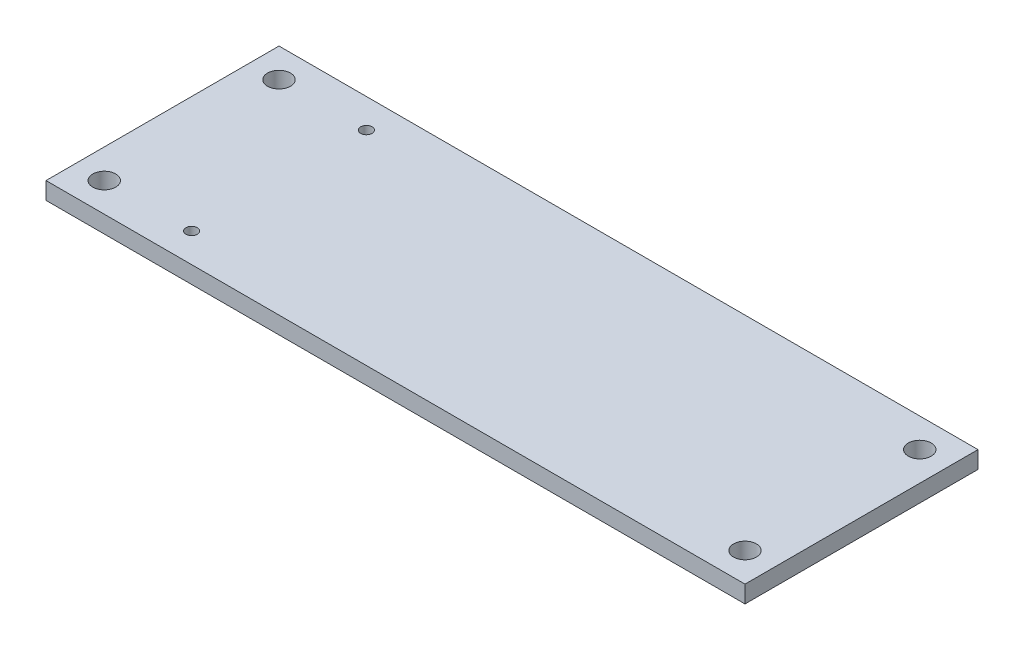
ISO-10303-21;
HEADER;
FILE_DESCRIPTION(('STEP AP214'),'2;1');
FILE_NAME('part.step','',(''),(''),'','','');
FILE_SCHEMA(('AUTOMOTIVE_DESIGN { 1 0 10303 214 1 1 1 1 }'));
ENDSEC;
DATA;
#1=APPLICATION_CONTEXT('core data for automotive mechanical design processes');
#2=APPLICATION_PROTOCOL_DEFINITION('international standard','automotive_design',2000,#1);
#3=PRODUCT_CONTEXT('',#1,'mechanical');
#4=PRODUCT('Part','Part','',(#3));
#5=PRODUCT_RELATED_PRODUCT_CATEGORY('part','',(#4));
#6=PRODUCT_DEFINITION_FORMATION('','',#4);
#7=PRODUCT_DEFINITION_CONTEXT('part definition',#1,'design');
#8=PRODUCT_DEFINITION('design','',#6,#7);
#9=PRODUCT_DEFINITION_SHAPE('','',#8);
#10=(LENGTH_UNIT() NAMED_UNIT(*) SI_UNIT(.MILLI.,.METRE.));
#11=(NAMED_UNIT(*) PLANE_ANGLE_UNIT() SI_UNIT($,.RADIAN.));
#12=(NAMED_UNIT(*) SI_UNIT($,.STERADIAN.) SOLID_ANGLE_UNIT());
#13=UNCERTAINTY_MEASURE_WITH_UNIT(LENGTH_MEASURE(1.E-05),#10,'distance_accuracy_value','');
#14=(GEOMETRIC_REPRESENTATION_CONTEXT(3) GLOBAL_UNCERTAINTY_ASSIGNED_CONTEXT((#13)) GLOBAL_UNIT_ASSIGNED_CONTEXT((#10,
#11,#12)) REPRESENTATION_CONTEXT('',''));
#15=CARTESIAN_POINT('',(0.,0.,0.));
#16=DIRECTION('',(0.,0.,1.));
#17=DIRECTION('',(1.,0.,0.));
#18=AXIS2_PLACEMENT_3D('',#15,#16,#17);
#19=CARTESIAN_POINT('',(0.,0.,0.));
#20=DIRECTION('',(0.,1.,0.));
#21=DIRECTION('',(0.,0.,1.));
#22=AXIS2_PLACEMENT_3D('',#19,#20,#21);
#23=PLANE('',#22);
#24=CARTESIAN_POINT('',(2.54,0.,-17.78));
#25=DIRECTION('',(0.,1.,0.));
#26=DIRECTION('',(0.,0.,1.));
#27=AXIS2_PLACEMENT_3D('',#24,#25,#26);
#28=CIRCLE('',#27,0.999999999999999);
#29=CARTESIAN_POINT('',(2.54,0.,-16.78));
#30=VERTEX_POINT('',#29);
#31=EDGE_CURVE('E158',#30,#30,#28,.F.);
#32=ORIENTED_EDGE('',*,*,#31,.F.);
#33=EDGE_LOOP('',(#32));
#34=FACE_BOUND('',#33,.T.);
#35=CARTESIAN_POINT('',(58.42,0.,-17.78));
#36=DIRECTION('',(0.,1.,0.));
#37=DIRECTION('',(0.,0.,1.));
#38=AXIS2_PLACEMENT_3D('',#35,#36,#37);
#39=CIRCLE('',#38,0.999999999999997);
#40=CARTESIAN_POINT('',(58.42,0.,-16.78));
#41=VERTEX_POINT('',#40);
#42=EDGE_CURVE('E155',#41,#41,#39,.T.);
#43=ORIENTED_EDGE('',*,*,#42,.T.);
#44=EDGE_LOOP('',(#43));
#45=FACE_BOUND('',#44,.T.);
#46=DIRECTION('',(1.,0.,0.));
#47=VECTOR('',#46,1.);
#48=CARTESIAN_POINT('',(0.,0.,0.));
#49=LINE('',#48,#47);
#50=CARTESIAN_POINT('',(0.,0.,0.));
#51=VERTEX_POINT('',#50);
#52=CARTESIAN_POINT('',(60.96,0.,0.));
#53=VERTEX_POINT('',#52);
#54=EDGE_CURVE('E147',#51,#53,#49,.T.);
#55=ORIENTED_EDGE('',*,*,#54,.F.);
#56=DIRECTION('',(0.,0.,-1.));
#57=VECTOR('',#56,1.);
#58=CARTESIAN_POINT('',(0.,0.,0.));
#59=LINE('',#58,#57);
#60=CARTESIAN_POINT('',(0.,0.,-20.32));
#61=VERTEX_POINT('',#60);
#62=EDGE_CURVE('E152',#51,#61,#59,.T.);
#63=ORIENTED_EDGE('',*,*,#62,.T.);
#64=DIRECTION('',(1.,0.,0.));
#65=VECTOR('',#64,1.);
#66=CARTESIAN_POINT('',(0.,0.,-20.32));
#67=LINE('',#66,#65);
#68=CARTESIAN_POINT('',(60.96,0.,-20.32));
#69=VERTEX_POINT('',#68);
#70=EDGE_CURVE('E150',#61,#69,#67,.T.);
#71=ORIENTED_EDGE('',*,*,#70,.T.);
#72=DIRECTION('',(0.,0.,-1.));
#73=VECTOR('',#72,1.);
#74=CARTESIAN_POINT('',(60.96,0.,0.));
#75=LINE('',#74,#73);
#76=EDGE_CURVE('E119',#53,#69,#75,.T.);
#77=ORIENTED_EDGE('',*,*,#76,.F.);
#78=EDGE_LOOP('',(#55,#63,#71,#77));
#79=FACE_BOUND('',#78,.T.);
#80=CARTESIAN_POINT('',(2.54,0.,-2.54));
#81=DIRECTION('',(0.,1.,0.));
#82=DIRECTION('',(0.,0.,1.));
#83=AXIS2_PLACEMENT_3D('',#80,#81,#82);
#84=CIRCLE('',#83,1.);
#85=CARTESIAN_POINT('',(2.54,0.,-1.54));
#86=VERTEX_POINT('',#85);
#87=EDGE_CURVE('E144',#86,#86,#84,.T.);
#88=ORIENTED_EDGE('',*,*,#87,.T.);
#89=EDGE_LOOP('',(#88));
#90=FACE_BOUND('',#89,.T.);
#91=CARTESIAN_POINT('',(58.42,0.,-2.54));
#92=DIRECTION('',(0.,1.,0.));
#93=DIRECTION('',(0.,0.,1.));
#94=AXIS2_PLACEMENT_3D('',#91,#92,#93);
#95=CIRCLE('',#94,0.999999999999998);
#96=CARTESIAN_POINT('',(58.42,0.,-1.54));
#97=VERTEX_POINT('',#96);
#98=EDGE_CURVE('E141',#97,#97,#95,.F.);
#99=ORIENTED_EDGE('',*,*,#98,.F.);
#100=EDGE_LOOP('',(#99));
#101=FACE_BOUND('',#100,.T.);
#102=CARTESIAN_POINT('',(10.16,0.,-2.54));
#103=DIRECTION('',(0.,1.,0.));
#104=DIRECTION('',(0.,0.,1.));
#105=AXIS2_PLACEMENT_3D('',#102,#103,#104);
#106=CIRCLE('',#105,0.500000000000001);
#107=CARTESIAN_POINT('',(10.16,0.,-2.04));
#108=VERTEX_POINT('',#107);
#109=EDGE_CURVE('E137',#108,#108,#106,.T.);
#110=ORIENTED_EDGE('',*,*,#109,.T.);
#111=EDGE_LOOP('',(#110));
#112=FACE_BOUND('',#111,.T.);
#113=CARTESIAN_POINT('',(10.16,0.,-17.78));
#114=DIRECTION('',(0.,1.,0.));
#115=DIRECTION('',(0.,0.,1.));
#116=AXIS2_PLACEMENT_3D('',#113,#114,#115);
#117=CIRCLE('',#116,0.500000000000001);
#118=CARTESIAN_POINT('',(10.16,0.,-17.28));
#119=VERTEX_POINT('',#118);
#120=EDGE_CURVE('E134',#119,#119,#117,.F.);
#121=ORIENTED_EDGE('',*,*,#120,.F.);
#122=EDGE_LOOP('',(#121));
#123=FACE_BOUND('',#122,.T.);
#124=CARTESIAN_POINT('',(53.34,0.,-11.11));
#125=DIRECTION('',(0.,-1.,0.));
#126=DIRECTION('',(0.,0.,-1.));
#127=AXIS2_PLACEMENT_3D('',#124,#125,#126);
#128=CIRCLE('',#127,0.499999999999999);
#129=CARTESIAN_POINT('',(53.34,0.,-11.61));
#130=VERTEX_POINT('',#129);
#131=EDGE_CURVE('E174',#130,#130,#128,.T.);
#132=ORIENTED_EDGE('',*,*,#131,.F.);
#133=EDGE_LOOP('',(#132));
#134=FACE_BOUND('',#133,.T.);
#135=CARTESIAN_POINT('',(53.34,0.,-8.57));
#136=DIRECTION('',(0.,1.,0.));
#137=DIRECTION('',(0.,0.,1.));
#138=AXIS2_PLACEMENT_3D('',#135,#136,#137);
#139=CIRCLE('',#138,0.499999999999999);
#140=CARTESIAN_POINT('',(53.34,0.,-8.07));
#141=VERTEX_POINT('',#140);
#142=EDGE_CURVE('E247',#141,#141,#139,.T.);
#143=ORIENTED_EDGE('',*,*,#142,.T.);
#144=EDGE_LOOP('',(#143));
#145=FACE_BOUND('',#144,.T.);
#146=ADVANCED_FACE('F63',(#34,#45,#79,#90,#101,#112,#123,#134,#145),#23,.F.);
#147=CARTESIAN_POINT('',(2.54,1.5,-17.78));
#148=DIRECTION('',(0.,-1.,0.));
#149=DIRECTION('',(0.,0.,-1.));
#150=AXIS2_PLACEMENT_3D('',#147,#148,#149);
#151=CYLINDRICAL_SURFACE('',#150,0.999999999999999);
#152=CARTESIAN_POINT('',(2.54,1.5,-17.78));
#153=DIRECTION('',(0.,1.,0.));
#154=DIRECTION('',(0.,0.,1.));
#155=AXIS2_PLACEMENT_3D('',#152,#153,#154);
#156=CIRCLE('',#155,0.999999999999999);
#157=CARTESIAN_POINT('',(2.54,1.5,-16.78));
#158=VERTEX_POINT('',#157);
#159=EDGE_CURVE('E131',#158,#158,#156,.F.);
#160=ORIENTED_EDGE('',*,*,#159,.F.);
#161=EDGE_LOOP('',(#160));
#162=FACE_BOUND('',#161,.T.);
#163=ORIENTED_EDGE('',*,*,#31,.T.);
#164=EDGE_LOOP('',(#163));
#165=FACE_BOUND('',#164,.T.);
#166=ADVANCED_FACE('F202',(#162,#165),#151,.F.);
#167=CARTESIAN_POINT('',(58.42,1.5,-17.78));
#168=DIRECTION('',(0.,-1.,0.));
#169=DIRECTION('',(0.,0.,-1.));
#170=AXIS2_PLACEMENT_3D('',#167,#168,#169);
#171=CYLINDRICAL_SURFACE('',#170,0.999999999999997);
#172=CARTESIAN_POINT('',(58.42,1.5,-17.78));
#173=DIRECTION('',(0.,1.,0.));
#174=DIRECTION('',(0.,0.,1.));
#175=AXIS2_PLACEMENT_3D('',#172,#173,#174);
#176=CIRCLE('',#175,0.999999999999997);
#177=CARTESIAN_POINT('',(58.42,1.5,-16.78));
#178=VERTEX_POINT('',#177);
#179=EDGE_CURVE('E125',#178,#178,#176,.T.);
#180=ORIENTED_EDGE('',*,*,#179,.T.);
#181=EDGE_LOOP('',(#180));
#182=FACE_BOUND('',#181,.T.);
#183=ORIENTED_EDGE('',*,*,#42,.F.);
#184=EDGE_LOOP('',(#183));
#185=FACE_BOUND('',#184,.T.);
#186=ADVANCED_FACE('F208',(#182,#185),#171,.F.);
#187=CARTESIAN_POINT('',(60.96,1.5,0.));
#188=DIRECTION('',(-1.,0.,0.));
#189=DIRECTION('',(0.,0.,1.));
#190=AXIS2_PLACEMENT_3D('',#187,#188,#189);
#191=PLANE('',#190);
#192=ORIENTED_EDGE('',*,*,#76,.T.);
#193=DIRECTION('',(0.,-1.,0.));
#194=VECTOR('',#193,1.);
#195=CARTESIAN_POINT('',(60.96,1.5,-20.32));
#196=LINE('',#195,#194);
#197=CARTESIAN_POINT('',(60.96,1.5,-20.32));
#198=VERTEX_POINT('',#197);
#199=EDGE_CURVE('E72',#198,#69,#196,.T.);
#200=ORIENTED_EDGE('',*,*,#199,.F.);
#201=DIRECTION('',(0.,0.,-1.));
#202=VECTOR('',#201,1.);
#203=CARTESIAN_POINT('',(60.96,1.5,0.));
#204=LINE('',#203,#202);
#205=CARTESIAN_POINT('',(60.96,1.5,0.));
#206=VERTEX_POINT('',#205);
#207=EDGE_CURVE('E105',#206,#198,#204,.T.);
#208=ORIENTED_EDGE('',*,*,#207,.F.);
#209=DIRECTION('',(0.,-1.,0.));
#210=VECTOR('',#209,1.);
#211=CARTESIAN_POINT('',(60.96,1.5,0.));
#212=LINE('',#211,#210);
#213=EDGE_CURVE('E12',#206,#53,#212,.T.);
#214=ORIENTED_EDGE('',*,*,#213,.T.);
#215=EDGE_LOOP('',(#192,#200,#208,#214));
#216=FACE_BOUND('',#215,.T.);
#217=ADVANCED_FACE('F118',(#216),#191,.F.);
#218=CARTESIAN_POINT('',(0.,1.5,-20.32));
#219=DIRECTION('',(0.,0.,-1.));
#220=DIRECTION('',(-1.,0.,0.));
#221=AXIS2_PLACEMENT_3D('',#218,#219,#220);
#222=PLANE('',#221);
#223=ORIENTED_EDGE('',*,*,#70,.F.);
#224=DIRECTION('',(0.,-1.,0.));
#225=VECTOR('',#224,1.);
#226=CARTESIAN_POINT('',(0.,1.5,-20.32));
#227=LINE('',#226,#225);
#228=CARTESIAN_POINT('',(0.,1.5,-20.32));
#229=VERTEX_POINT('',#228);
#230=EDGE_CURVE('E94',#229,#61,#227,.T.);
#231=ORIENTED_EDGE('',*,*,#230,.F.);
#232=DIRECTION('',(1.,0.,0.));
#233=VECTOR('',#232,1.);
#234=CARTESIAN_POINT('',(0.,1.5,-20.32));
#235=LINE('',#234,#233);
#236=EDGE_CURVE('E113',#229,#198,#235,.T.);
#237=ORIENTED_EDGE('',*,*,#236,.T.);
#238=ORIENTED_EDGE('',*,*,#199,.T.);
#239=EDGE_LOOP('',(#223,#231,#237,#238));
#240=FACE_BOUND('',#239,.T.);
#241=ADVANCED_FACE('F122',(#240),#222,.T.);
#242=CARTESIAN_POINT('',(0.,1.5,0.));
#243=DIRECTION('',(-1.,0.,0.));
#244=DIRECTION('',(0.,0.,1.));
#245=AXIS2_PLACEMENT_3D('',#242,#243,#244);
#246=PLANE('',#245);
#247=ORIENTED_EDGE('',*,*,#62,.F.);
#248=DIRECTION('',(0.,-1.,0.));
#249=VECTOR('',#248,1.);
#250=CARTESIAN_POINT('',(0.,1.5,0.));
#251=LINE('',#250,#249);
#252=CARTESIAN_POINT('',(0.,1.5,0.));
#253=VERTEX_POINT('',#252);
#254=EDGE_CURVE('E80',#253,#51,#251,.T.);
#255=ORIENTED_EDGE('',*,*,#254,.F.);
#256=DIRECTION('',(0.,0.,-1.));
#257=VECTOR('',#256,1.);
#258=CARTESIAN_POINT('',(0.,1.5,0.));
#259=LINE('',#258,#257);
#260=EDGE_CURVE('E123',#253,#229,#259,.T.);
#261=ORIENTED_EDGE('',*,*,#260,.T.);
#262=ORIENTED_EDGE('',*,*,#230,.T.);
#263=EDGE_LOOP('',(#247,#255,#261,#262));
#264=FACE_BOUND('',#263,.T.);
#265=ADVANCED_FACE('F216',(#264),#246,.T.);
#266=CARTESIAN_POINT('',(0.,1.5,0.));
#267=DIRECTION('',(0.,0.,-1.));
#268=DIRECTION('',(-1.,0.,0.));
#269=AXIS2_PLACEMENT_3D('',#266,#267,#268);
#270=PLANE('',#269);
#271=ORIENTED_EDGE('',*,*,#54,.T.);
#272=ORIENTED_EDGE('',*,*,#213,.F.);
#273=DIRECTION('',(1.,0.,0.));
#274=VECTOR('',#273,1.);
#275=CARTESIAN_POINT('',(0.,1.5,0.));
#276=LINE('',#275,#274);
#277=EDGE_CURVE('E114',#253,#206,#276,.T.);
#278=ORIENTED_EDGE('',*,*,#277,.F.);
#279=ORIENTED_EDGE('',*,*,#254,.T.);
#280=EDGE_LOOP('',(#271,#272,#278,#279));
#281=FACE_BOUND('',#280,.T.);
#282=ADVANCED_FACE('F219',(#281),#270,.F.);
#283=CARTESIAN_POINT('',(2.54,1.5,-2.54));
#284=DIRECTION('',(0.,-1.,0.));
#285=DIRECTION('',(0.,0.,-1.));
#286=AXIS2_PLACEMENT_3D('',#283,#284,#285);
#287=CYLINDRICAL_SURFACE('',#286,1.);
#288=CARTESIAN_POINT('',(2.54,1.5,-2.54));
#289=DIRECTION('',(0.,1.,0.));
#290=DIRECTION('',(0.,0.,1.));
#291=AXIS2_PLACEMENT_3D('',#288,#289,#290);
#292=CIRCLE('',#291,1.);
#293=CARTESIAN_POINT('',(2.54,1.5,-1.54));
#294=VERTEX_POINT('',#293);
#295=EDGE_CURVE('E179',#294,#294,#292,.T.);
#296=ORIENTED_EDGE('',*,*,#295,.T.);
#297=EDGE_LOOP('',(#296));
#298=FACE_BOUND('',#297,.T.);
#299=ORIENTED_EDGE('',*,*,#87,.F.);
#300=EDGE_LOOP('',(#299));
#301=FACE_BOUND('',#300,.T.);
#302=ADVANCED_FACE('F183',(#298,#301),#287,.F.);
#303=CARTESIAN_POINT('',(58.42,1.5,-2.54));
#304=DIRECTION('',(0.,-1.,0.));
#305=DIRECTION('',(0.,0.,-1.));
#306=AXIS2_PLACEMENT_3D('',#303,#304,#305);
#307=CYLINDRICAL_SURFACE('',#306,0.999999999999998);
#308=CARTESIAN_POINT('',(58.42,1.5,-2.54));
#309=DIRECTION('',(0.,1.,0.));
#310=DIRECTION('',(0.,0.,1.));
#311=AXIS2_PLACEMENT_3D('',#308,#309,#310);
#312=CIRCLE('',#311,0.999999999999998);
#313=CARTESIAN_POINT('',(58.42,1.5,-1.54));
#314=VERTEX_POINT('',#313);
#315=EDGE_CURVE('E171',#314,#314,#312,.F.);
#316=ORIENTED_EDGE('',*,*,#315,.F.);
#317=EDGE_LOOP('',(#316));
#318=FACE_BOUND('',#317,.T.);
#319=ORIENTED_EDGE('',*,*,#98,.T.);
#320=EDGE_LOOP('',(#319));
#321=FACE_BOUND('',#320,.T.);
#322=ADVANCED_FACE('F228',(#318,#321),#307,.F.);
#323=CARTESIAN_POINT('',(10.16,1.5,-2.54));
#324=DIRECTION('',(0.,-1.,0.));
#325=DIRECTION('',(0.,0.,-1.));
#326=AXIS2_PLACEMENT_3D('',#323,#324,#325);
#327=CYLINDRICAL_SURFACE('',#326,0.500000000000001);
#328=CARTESIAN_POINT('',(10.16,1.5,-2.54));
#329=DIRECTION('',(0.,1.,0.));
#330=DIRECTION('',(0.,0.,1.));
#331=AXIS2_PLACEMENT_3D('',#328,#329,#330);
#332=CIRCLE('',#331,0.500000000000001);
#333=CARTESIAN_POINT('',(10.16,1.5,-2.04));
#334=VERTEX_POINT('',#333);
#335=EDGE_CURVE('E166',#334,#334,#332,.T.);
#336=ORIENTED_EDGE('',*,*,#335,.T.);
#337=EDGE_LOOP('',(#336));
#338=FACE_BOUND('',#337,.T.);
#339=ORIENTED_EDGE('',*,*,#109,.F.);
#340=EDGE_LOOP('',(#339));
#341=FACE_BOUND('',#340,.T.);
#342=ADVANCED_FACE('F197',(#338,#341),#327,.F.);
#343=CARTESIAN_POINT('',(10.16,1.5,-17.78));
#344=DIRECTION('',(0.,-1.,0.));
#345=DIRECTION('',(0.,0.,-1.));
#346=AXIS2_PLACEMENT_3D('',#343,#344,#345);
#347=CYLINDRICAL_SURFACE('',#346,0.500000000000001);
#348=CARTESIAN_POINT('',(10.16,1.5,-17.78));
#349=DIRECTION('',(0.,1.,0.));
#350=DIRECTION('',(0.,0.,1.));
#351=AXIS2_PLACEMENT_3D('',#348,#349,#350);
#352=CIRCLE('',#351,0.500000000000001);
#353=CARTESIAN_POINT('',(10.16,1.5,-17.28));
#354=VERTEX_POINT('',#353);
#355=EDGE_CURVE('E161',#354,#354,#352,.F.);
#356=ORIENTED_EDGE('',*,*,#355,.F.);
#357=EDGE_LOOP('',(#356));
#358=FACE_BOUND('',#357,.T.);
#359=ORIENTED_EDGE('',*,*,#120,.T.);
#360=EDGE_LOOP('',(#359));
#361=FACE_BOUND('',#360,.T.);
#362=ADVANCED_FACE('F65',(#358,#361),#347,.F.);
#363=CARTESIAN_POINT('',(0.,1.5,0.));
#364=DIRECTION('',(0.,1.,0.));
#365=DIRECTION('',(0.,0.,1.));
#366=AXIS2_PLACEMENT_3D('',#363,#364,#365);
#367=PLANE('',#366);
#368=ORIENTED_EDGE('',*,*,#355,.T.);
#369=EDGE_LOOP('',(#368));
#370=FACE_BOUND('',#369,.T.);
#371=ORIENTED_EDGE('',*,*,#335,.F.);
#372=EDGE_LOOP('',(#371));
#373=FACE_BOUND('',#372,.T.);
#374=ORIENTED_EDGE('',*,*,#315,.T.);
#375=EDGE_LOOP('',(#374));
#376=FACE_BOUND('',#375,.T.);
#377=ORIENTED_EDGE('',*,*,#295,.F.);
#378=EDGE_LOOP('',(#377));
#379=FACE_BOUND('',#378,.T.);
#380=ORIENTED_EDGE('',*,*,#277,.T.);
#381=ORIENTED_EDGE('',*,*,#207,.T.);
#382=ORIENTED_EDGE('',*,*,#236,.F.);
#383=ORIENTED_EDGE('',*,*,#260,.F.);
#384=EDGE_LOOP('',(#380,#381,#382,#383));
#385=FACE_BOUND('',#384,.T.);
#386=ORIENTED_EDGE('',*,*,#179,.F.);
#387=EDGE_LOOP('',(#386));
#388=FACE_BOUND('',#387,.T.);
#389=ORIENTED_EDGE('',*,*,#159,.T.);
#390=EDGE_LOOP('',(#389));
#391=FACE_BOUND('',#390,.T.);
#392=ADVANCED_FACE('F109',(#370,#373,#376,#379,#385,#388,#391),#367,.T.);
#393=CARTESIAN_POINT('',(53.34,0.03,-11.11));
#394=DIRECTION('',(0.,-1.,0.));
#395=DIRECTION('',(0.,0.,-1.));
#396=AXIS2_PLACEMENT_3D('',#393,#394,#395);
#397=CYLINDRICAL_SURFACE('',#396,0.499999999999999);
#398=CARTESIAN_POINT('',(53.34,0.03,-11.11));
#399=DIRECTION('',(0.,-1.,0.));
#400=DIRECTION('',(0.,0.,-1.));
#401=AXIS2_PLACEMENT_3D('',#398,#399,#400);
#402=CIRCLE('',#401,0.499999999999999);
#403=CARTESIAN_POINT('',(53.34,0.03,-11.61));
#404=VERTEX_POINT('',#403);
#405=EDGE_CURVE('E138',#404,#404,#402,.T.);
#406=ORIENTED_EDGE('',*,*,#405,.F.);
#407=EDGE_LOOP('',(#406));
#408=FACE_BOUND('',#407,.T.);
#409=ORIENTED_EDGE('',*,*,#131,.T.);
#410=EDGE_LOOP('',(#409));
#411=FACE_BOUND('',#410,.T.);
#412=ADVANCED_FACE('F187',(#408,#411),#397,.F.);
#413=CARTESIAN_POINT('',(53.34,0.03,-11.11));
#414=DIRECTION('',(0.,-1.,0.));
#415=DIRECTION('',(0.,0.,-1.));
#416=AXIS2_PLACEMENT_3D('',#413,#414,#415);
#417=PLANE('',#416);
#418=ORIENTED_EDGE('',*,*,#405,.T.);
#419=EDGE_LOOP('',(#418));
#420=FACE_BOUND('',#419,.T.);
#421=ADVANCED_FACE('F194',(#420),#417,.T.);
#422=CARTESIAN_POINT('',(53.34,0.03,-8.57));
#423=DIRECTION('',(0.,-1.,0.));
#424=DIRECTION('',(0.,0.,-1.));
#425=AXIS2_PLACEMENT_3D('',#422,#423,#424);
#426=CYLINDRICAL_SURFACE('',#425,0.499999999999999);
#427=CARTESIAN_POINT('',(53.34,0.03,-8.57));
#428=DIRECTION('',(0.,1.,0.));
#429=DIRECTION('',(0.,0.,1.));
#430=AXIS2_PLACEMENT_3D('',#427,#428,#429);
#431=CIRCLE('',#430,0.499999999999999);
#432=CARTESIAN_POINT('',(53.34,0.03,-8.07));
#433=VERTEX_POINT('',#432);
#434=EDGE_CURVE('E249',#433,#433,#431,.T.);
#435=ORIENTED_EDGE('',*,*,#434,.T.);
#436=EDGE_LOOP('',(#435));
#437=FACE_BOUND('',#436,.T.);
#438=ORIENTED_EDGE('',*,*,#142,.F.);
#439=EDGE_LOOP('',(#438));
#440=FACE_BOUND('',#439,.T.);
#441=ADVANCED_FACE('F258',(#437,#440),#426,.F.);
#442=CARTESIAN_POINT('',(53.34,0.03,-8.57));
#443=DIRECTION('',(0.,1.,0.));
#444=DIRECTION('',(0.,0.,1.));
#445=AXIS2_PLACEMENT_3D('',#442,#443,#444);
#446=PLANE('',#445);
#447=ORIENTED_EDGE('',*,*,#434,.F.);
#448=EDGE_LOOP('',(#447));
#449=FACE_BOUND('',#448,.T.);
#450=ADVANCED_FACE('F263',(#449),#446,.F.);
#451=CLOSED_SHELL('',(#146,#166,#186,#217,#241,#265,#282,#302,#322,#342,#362,#392,#412,#421,
#441,#450));
#452=MANIFOLD_SOLID_BREP('B2',#451);
#453=ADVANCED_BREP_SHAPE_REPRESENTATION('',(#18,#452),#14);
#454=SHAPE_DEFINITION_REPRESENTATION(#9,#453);
ENDSEC;
END-ISO-10303-21;
